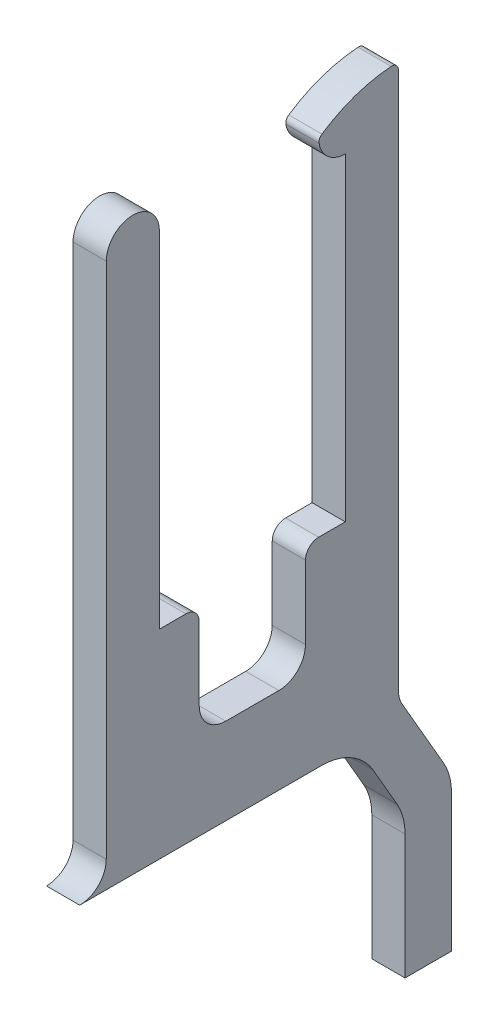
ISO-10303-21;
HEADER;
FILE_DESCRIPTION(('STEP AP214'),'2;1');
FILE_NAME('part.step','',(''),(''),'','','');
FILE_SCHEMA(('AUTOMOTIVE_DESIGN { 1 0 10303 214 1 1 1 1 }'));
ENDSEC;
DATA;
#1=APPLICATION_CONTEXT('core data for automotive mechanical design processes');
#2=APPLICATION_PROTOCOL_DEFINITION('international standard','automotive_design',2000,#1);
#3=PRODUCT_CONTEXT('',#1,'mechanical');
#4=PRODUCT('Part','Part','',(#3));
#5=PRODUCT_RELATED_PRODUCT_CATEGORY('part','',(#4));
#6=PRODUCT_DEFINITION_FORMATION('','',#4);
#7=PRODUCT_DEFINITION_CONTEXT('part definition',#1,'design');
#8=PRODUCT_DEFINITION('design','',#6,#7);
#9=PRODUCT_DEFINITION_SHAPE('','',#8);
#10=(LENGTH_UNIT() NAMED_UNIT(*) SI_UNIT(.MILLI.,.METRE.));
#11=(NAMED_UNIT(*) PLANE_ANGLE_UNIT() SI_UNIT($,.RADIAN.));
#12=(NAMED_UNIT(*) SI_UNIT($,.STERADIAN.) SOLID_ANGLE_UNIT());
#13=UNCERTAINTY_MEASURE_WITH_UNIT(LENGTH_MEASURE(1.E-05),#10,'distance_accuracy_value','');
#14=(GEOMETRIC_REPRESENTATION_CONTEXT(3) GLOBAL_UNCERTAINTY_ASSIGNED_CONTEXT((#13)) GLOBAL_UNIT_ASSIGNED_CONTEXT((#10,
#11,#12)) REPRESENTATION_CONTEXT('',''));
#15=CARTESIAN_POINT('',(0.,0.,0.));
#16=DIRECTION('',(0.,0.,1.));
#17=DIRECTION('',(1.,0.,0.));
#18=AXIS2_PLACEMENT_3D('',#15,#16,#17);
#19=CARTESIAN_POINT('',(-0.125,-1.3,-0.2));
#20=DIRECTION('',(-1.,0.,0.));
#21=DIRECTION('',(0.,-1.,0.));
#22=AXIS2_PLACEMENT_3D('',#19,#20,#21);
#23=PLANE('',#22);
#24=CARTESIAN_POINT('',(-0.125,1.95,-0.7));
#25=DIRECTION('',(1.,0.,0.));
#26=DIRECTION('',(0.,0.,-1.));
#27=AXIS2_PLACEMENT_3D('',#24,#25,#26);
#28=CIRCLE('',#27,0.200000000000005);
#29=CARTESIAN_POINT('',(-0.125,1.9170218477242,-0.502737632903597));
#30=VERTEX_POINT('',#29);
#31=CARTESIAN_POINT('',(-0.125,1.75,-0.7));
#32=VERTEX_POINT('',#31);
#33=EDGE_CURVE('E218',#30,#32,#28,.T.);
#34=ORIENTED_EDGE('',*,*,#33,.F.);
#35=CARTESIAN_POINT('',(-0.125,1.92526638579315,-0.552053224677697));
#36=DIRECTION('',(1.,0.,0.));
#37=DIRECTION('',(0.,0.,-1.));
#38=AXIS2_PLACEMENT_3D('',#35,#36,#37);
#39=CIRCLE('',#38,0.05);
#40=CARTESIAN_POINT('',(-0.125,1.96673103676035,-0.52411252461185));
#41=VERTEX_POINT('',#40);
#42=EDGE_CURVE('E342',#41,#30,#39,.T.);
#43=ORIENTED_EDGE('',*,*,#42,.F.);
#44=CARTESIAN_POINT('',(-0.125,1.075,-1.125));
#45=DIRECTION('',(1.,0.,0.));
#46=DIRECTION('',(0.,0.,-1.));
#47=AXIS2_PLACEMENT_3D('',#44,#45,#46);
#48=CIRCLE('',#47,1.07529065838034);
#49=CARTESIAN_POINT('',(-0.125,2.14740990194198,-1.04634250056864));
#50=VERTEX_POINT('',#49);
#51=EDGE_CURVE('E339',#50,#41,#48,.T.);
#52=ORIENTED_EDGE('',*,*,#51,.F.);
#53=CARTESIAN_POINT('',(-0.125,2.09754385439548,-1.05));
#54=DIRECTION('',(1.,0.,0.));
#55=DIRECTION('',(0.,0.,-1.));
#56=AXIS2_PLACEMENT_3D('',#53,#54,#55);
#57=CIRCLE('',#56,0.05);
#58=CARTESIAN_POINT('',(-0.125,2.09754385439548,-1.1));
#59=VERTEX_POINT('',#58);
#60=EDGE_CURVE('E206',#59,#50,#57,.T.);
#61=ORIENTED_EDGE('',*,*,#60,.F.);
#62=DIRECTION('',(0.,1.,0.));
#63=VECTOR('',#62,1.);
#64=CARTESIAN_POINT('',(-0.125,-2.15,-1.1));
#65=LINE('',#64,#63);
#66=CARTESIAN_POINT('',(-0.125,-1.95,-1.1));
#67=VERTEX_POINT('',#66);
#68=EDGE_CURVE('E201',#59,#67,#65,.F.);
#69=ORIENTED_EDGE('',*,*,#68,.T.);
#70=CARTESIAN_POINT('',(-0.125,-1.95,-1.3));
#71=DIRECTION('',(1.,0.,0.));
#72=DIRECTION('',(0.,0.,-1.));
#73=AXIS2_PLACEMENT_3D('',#70,#71,#72);
#74=CIRCLE('',#73,0.199999999999998);
#75=CARTESIAN_POINT('',(-0.125,-2.05,-1.12679491924311));
#76=VERTEX_POINT('',#75);
#77=EDGE_CURVE('E19',#67,#76,#74,.T.);
#78=ORIENTED_EDGE('',*,*,#77,.T.);
#79=DIRECTION('',(0.,0.866025403784439,0.5));
#80=VECTOR('',#79,1.);
#81=CARTESIAN_POINT('',(-0.125,-2.05,-1.12679491924311));
#82=LINE('',#81,#80);
#83=CARTESIAN_POINT('',(-0.125,-2.59198729810792,-1.43971143170307));
#84=VERTEX_POINT('',#83);
#85=EDGE_CURVE('E199',#84,#76,#82,.T.);
#86=ORIENTED_EDGE('',*,*,#85,.F.);
#87=CARTESIAN_POINT('',(-0.125,-2.81698729810792,-1.05000000000007));
#88=DIRECTION('',(1.,0.,0.));
#89=DIRECTION('',(0.,0.,-1.));
#90=AXIS2_PLACEMENT_3D('',#87,#88,#89);
#91=CIRCLE('',#90,0.45);
#92=CARTESIAN_POINT('',(-0.125,-2.81698729810792,-1.50000000000008));
#93=VERTEX_POINT('',#92);
#94=EDGE_CURVE('E363',#93,#84,#91,.T.);
#95=ORIENTED_EDGE('',*,*,#94,.F.);
#96=DIRECTION('',(0.,1.,0.));
#97=VECTOR('',#96,1.);
#98=CARTESIAN_POINT('',(-0.125,-3.85,-1.50000000000008));
#99=LINE('',#98,#97);
#100=CARTESIAN_POINT('',(-0.125,-3.85,-1.50000000000008));
#101=VERTEX_POINT('',#100);
#102=EDGE_CURVE('E280',#101,#93,#99,.T.);
#103=ORIENTED_EDGE('',*,*,#102,.F.);
#104=DIRECTION('',(0.,0.,-1.));
#105=VECTOR('',#104,1.);
#106=CARTESIAN_POINT('',(-0.125,-3.85,-1.15000000000007));
#107=LINE('',#106,#105);
#108=CARTESIAN_POINT('',(-0.125,-3.85,-1.15000000000008));
#109=VERTEX_POINT('',#108);
#110=EDGE_CURVE('E274',#109,#101,#107,.T.);
#111=ORIENTED_EDGE('',*,*,#110,.F.);
#112=DIRECTION('',(0.,-1.,0.));
#113=VECTOR('',#112,1.);
#114=CARTESIAN_POINT('',(-0.125,-2.79019237886481,-1.15000000000008));
#115=LINE('',#114,#113);
#116=CARTESIAN_POINT('',(-0.125,-2.91076951545881,-1.15000000000008));
#117=VERTEX_POINT('',#116);
#118=EDGE_CURVE('E267',#117,#109,#115,.T.);
#119=ORIENTED_EDGE('',*,*,#118,.F.);
#120=CARTESIAN_POINT('',(-0.125,-2.91076951545881,-0.700000000000075));
#121=DIRECTION('',(-1.,0.,0.));
#122=DIRECTION('',(0.,0.,1.));
#123=AXIS2_PLACEMENT_3D('',#120,#121,#122);
#124=CIRCLE('',#123,0.45);
#125=CARTESIAN_POINT('',(-0.125,-2.68576951545881,-1.08971143170307));
#126=VERTEX_POINT('',#125);
#127=EDGE_CURVE('E266',#117,#126,#124,.F.);
#128=ORIENTED_EDGE('',*,*,#127,.T.);
#129=DIRECTION('',(0.,-0.866025403784439,-0.5));
#130=VECTOR('',#129,1.);
#131=CARTESIAN_POINT('',(-0.125,-2.79019237886481,-1.15000000000008));
#132=LINE('',#131,#130);
#133=CARTESIAN_POINT('',(-0.125,-2.375,-0.910288568296999));
#134=VERTEX_POINT('',#133);
#135=EDGE_CURVE('E263',#134,#126,#132,.T.);
#136=ORIENTED_EDGE('',*,*,#135,.F.);
#137=CARTESIAN_POINT('',(-0.125,-2.6,-0.520577136594));
#138=DIRECTION('',(1.,0.,0.));
#139=DIRECTION('',(0.,0.,-1.));
#140=AXIS2_PLACEMENT_3D('',#137,#138,#139);
#141=CIRCLE('',#140,0.45);
#142=CARTESIAN_POINT('',(-0.125,-2.15,-0.520577136594));
#143=VERTEX_POINT('',#142);
#144=EDGE_CURVE('E358',#134,#143,#141,.T.);
#145=ORIENTED_EDGE('',*,*,#144,.T.);
#146=DIRECTION('',(0.,0.,1.));
#147=VECTOR('',#146,1.);
#148=CARTESIAN_POINT('',(-0.125,-2.15,1.1));
#149=LINE('',#148,#147);
#150=CARTESIAN_POINT('',(-0.125,-2.15,1.3));
#151=VERTEX_POINT('',#150);
#152=EDGE_CURVE('E259',#143,#151,#149,.T.);
#153=ORIENTED_EDGE('',*,*,#152,.T.);
#154=CARTESIAN_POINT('',(-0.125,-1.95,1.3));
#155=DIRECTION('',(1.,0.,0.));
#156=DIRECTION('',(0.,0.,-1.));
#157=AXIS2_PLACEMENT_3D('',#154,#155,#156);
#158=CIRCLE('',#157,0.199999999999998);
#159=CARTESIAN_POINT('',(-0.125,-1.95,1.1));
#160=VERTEX_POINT('',#159);
#161=EDGE_CURVE('E356',#151,#160,#158,.T.);
#162=ORIENTED_EDGE('',*,*,#161,.T.);
#163=DIRECTION('',(0.,1.,0.));
#164=VECTOR('',#163,1.);
#165=CARTESIAN_POINT('',(-0.125,2.15,1.1));
#166=LINE('',#165,#164);
#167=CARTESIAN_POINT('',(-0.125,1.95,1.1));
#168=VERTEX_POINT('',#167);
#169=EDGE_CURVE('E254',#160,#168,#166,.T.);
#170=ORIENTED_EDGE('',*,*,#169,.T.);
#171=CARTESIAN_POINT('',(-0.125,1.95,0.9));
#172=DIRECTION('',(1.,0.,0.));
#173=DIRECTION('',(0.,0.,-1.));
#174=AXIS2_PLACEMENT_3D('',#171,#172,#173);
#175=CIRCLE('',#174,0.2);
#176=CARTESIAN_POINT('',(-0.125,1.95,0.7));
#177=VERTEX_POINT('',#176);
#178=EDGE_CURVE('E257',#177,#168,#175,.T.);
#179=ORIENTED_EDGE('',*,*,#178,.F.);
#180=DIRECTION('',(0.,-1.,0.));
#181=VECTOR('',#180,1.);
#182=CARTESIAN_POINT('',(-0.125,2.15,0.7));
#183=LINE('',#182,#181);
#184=CARTESIAN_POINT('',(-0.125,-0.65,0.7));
#185=VERTEX_POINT('',#184);
#186=EDGE_CURVE('E248',#177,#185,#183,.T.);
#187=ORIENTED_EDGE('',*,*,#186,.T.);
#188=DIRECTION('',(0.,0.,-1.));
#189=VECTOR('',#188,1.);
#190=CARTESIAN_POINT('',(-0.125,-0.65,0.4));
#191=LINE('',#190,#189);
#192=CARTESIAN_POINT('',(-0.125,-0.65,0.5));
#193=VERTEX_POINT('',#192);
#194=EDGE_CURVE('E241',#185,#193,#191,.T.);
#195=ORIENTED_EDGE('',*,*,#194,.T.);
#196=CARTESIAN_POINT('',(-0.125,-0.75,0.5));
#197=DIRECTION('',(1.,0.,0.));
#198=DIRECTION('',(0.,0.,-1.));
#199=AXIS2_PLACEMENT_3D('',#196,#197,#198);
#200=CIRCLE('',#199,0.1);
#201=CARTESIAN_POINT('',(-0.125,-0.75,0.4));
#202=VERTEX_POINT('',#201);
#203=EDGE_CURVE('E244',#202,#193,#200,.T.);
#204=ORIENTED_EDGE('',*,*,#203,.F.);
#205=DIRECTION('',(0.,1.,0.));
#206=VECTOR('',#205,1.);
#207=CARTESIAN_POINT('',(-0.125,-1.3,0.4));
#208=LINE('',#207,#206);
#209=CARTESIAN_POINT('',(-0.125,-1.3,0.4));
#210=VERTEX_POINT('',#209);
#211=EDGE_CURVE('E237',#202,#210,#208,.F.);
#212=ORIENTED_EDGE('',*,*,#211,.T.);
#213=CARTESIAN_POINT('',(-0.125,-1.3,0.2));
#214=DIRECTION('',(1.,0.,0.));
#215=DIRECTION('',(0.,0.,-1.));
#216=AXIS2_PLACEMENT_3D('',#213,#214,#215);
#217=CIRCLE('',#216,0.2);
#218=CARTESIAN_POINT('',(-0.125,-1.5,0.2));
#219=VERTEX_POINT('',#218);
#220=EDGE_CURVE('E350',#210,#219,#217,.T.);
#221=ORIENTED_EDGE('',*,*,#220,.T.);
#222=DIRECTION('',(0.,0.,-1.));
#223=VECTOR('',#222,1.);
#224=CARTESIAN_POINT('',(-0.125,-1.5,0.2));
#225=LINE('',#224,#223);
#226=CARTESIAN_POINT('',(-0.125,-1.5,-0.2));
#227=VERTEX_POINT('',#226);
#228=EDGE_CURVE('E233',#219,#227,#225,.T.);
#229=ORIENTED_EDGE('',*,*,#228,.T.);
#230=CARTESIAN_POINT('',(-0.125,-1.3,-0.2));
#231=DIRECTION('',(1.,0.,0.));
#232=DIRECTION('',(0.,0.,-1.));
#233=AXIS2_PLACEMENT_3D('',#230,#231,#232);
#234=CIRCLE('',#233,0.2);
#235=CARTESIAN_POINT('',(-0.125,-1.3,-0.4));
#236=VERTEX_POINT('',#235);
#237=EDGE_CURVE('E348',#227,#236,#234,.T.);
#238=ORIENTED_EDGE('',*,*,#237,.T.);
#239=DIRECTION('',(0.,1.,0.));
#240=VECTOR('',#239,1.);
#241=CARTESIAN_POINT('',(-0.125,-1.3,-0.4));
#242=LINE('',#241,#240);
#243=CARTESIAN_POINT('',(-0.125,-0.75,-0.4));
#244=VERTEX_POINT('',#243);
#245=EDGE_CURVE('E228',#236,#244,#242,.T.);
#246=ORIENTED_EDGE('',*,*,#245,.T.);
#247=CARTESIAN_POINT('',(-0.125,-0.75,-0.5));
#248=DIRECTION('',(1.,0.,0.));
#249=DIRECTION('',(0.,0.,-1.));
#250=AXIS2_PLACEMENT_3D('',#247,#248,#249);
#251=CIRCLE('',#250,0.1);
#252=CARTESIAN_POINT('',(-0.125,-0.65,-0.5));
#253=VERTEX_POINT('',#252);
#254=EDGE_CURVE('E231',#253,#244,#251,.T.);
#255=ORIENTED_EDGE('',*,*,#254,.F.);
#256=DIRECTION('',(0.,0.,-1.));
#257=VECTOR('',#256,1.);
#258=CARTESIAN_POINT('',(-0.125,-0.65,-0.4));
#259=LINE('',#258,#257);
#260=CARTESIAN_POINT('',(-0.125,-0.65,-0.7));
#261=VERTEX_POINT('',#260);
#262=EDGE_CURVE('E222',#253,#261,#259,.T.);
#263=ORIENTED_EDGE('',*,*,#262,.T.);
#264=DIRECTION('',(0.,1.,0.));
#265=VECTOR('',#264,1.);
#266=CARTESIAN_POINT('',(-0.125,-0.65,-0.7));
#267=LINE('',#266,#265);
#268=EDGE_CURVE('E215',#261,#32,#267,.T.);
#269=ORIENTED_EDGE('',*,*,#268,.T.);
#270=EDGE_LOOP('',(#34,#43,#52,#61,#69,#78,#86,#95,#103,#111,#119,#128,#136,#145,#153,#162,#170,
#179,#187,#195,#204,#212,#221,#229,#238,#246,#255,#263,#269));
#271=FACE_BOUND('',#270,.T.);
#272=ADVANCED_FACE('F16',(#271),#23,.T.);
#273=CARTESIAN_POINT('',(0.125,-1.95,-1.3));
#274=DIRECTION('',(1.,0.,0.));
#275=DIRECTION('',(0.,0.,-1.));
#276=AXIS2_PLACEMENT_3D('',#273,#274,#275);
#277=CYLINDRICAL_SURFACE('',#276,0.199999999999998);
#278=DIRECTION('',(1.,0.,0.));
#279=VECTOR('',#278,1.);
#280=CARTESIAN_POINT('',(0.125,-1.95,-1.1));
#281=LINE('',#280,#279);
#282=CARTESIAN_POINT('',(0.125,-1.95,-1.1));
#283=VERTEX_POINT('',#282);
#284=EDGE_CURVE('E194',#67,#283,#281,.T.);
#285=ORIENTED_EDGE('',*,*,#284,.T.);
#286=CARTESIAN_POINT('',(0.125,-1.95,-1.3));
#287=DIRECTION('',(1.,0.,0.));
#288=DIRECTION('',(0.,0.,-1.));
#289=AXIS2_PLACEMENT_3D('',#286,#287,#288);
#290=CIRCLE('',#289,0.199999999999998);
#291=CARTESIAN_POINT('',(0.125,-2.05,-1.12679491924311));
#292=VERTEX_POINT('',#291);
#293=EDGE_CURVE('E207',#283,#292,#290,.T.);
#294=ORIENTED_EDGE('',*,*,#293,.T.);
#295=DIRECTION('',(1.,0.,0.));
#296=VECTOR('',#295,1.);
#297=CARTESIAN_POINT('',(0.125,-2.05,-1.12679491924311));
#298=LINE('',#297,#296);
#299=EDGE_CURVE('E195',#76,#292,#298,.T.);
#300=ORIENTED_EDGE('',*,*,#299,.F.);
#301=ORIENTED_EDGE('',*,*,#77,.F.);
#302=EDGE_LOOP('',(#285,#294,#300,#301));
#303=FACE_BOUND('',#302,.T.);
#304=ADVANCED_FACE('F192',(#303),#277,.F.);
#305=CARTESIAN_POINT('',(0.125,-2.05,-1.12679491924311));
#306=DIRECTION('',(0.,0.5,-0.866025403784439));
#307=DIRECTION('',(0.,0.866025403784439,0.5));
#308=AXIS2_PLACEMENT_3D('',#305,#306,#307);
#309=PLANE('',#308);
#310=ORIENTED_EDGE('',*,*,#85,.T.);
#311=ORIENTED_EDGE('',*,*,#299,.T.);
#312=DIRECTION('',(0.,-0.866025403784443,-0.499999999999993));
#313=VECTOR('',#312,1.);
#314=CARTESIAN_POINT('',(0.125,-2.05,-1.12679491924311));
#315=LINE('',#314,#313);
#316=CARTESIAN_POINT('',(0.125,-2.59198729810792,-1.43971143170307));
#317=VERTEX_POINT('',#316);
#318=EDGE_CURVE('E209',#292,#317,#315,.T.);
#319=ORIENTED_EDGE('',*,*,#318,.T.);
#320=DIRECTION('',(1.,0.,0.));
#321=VECTOR('',#320,1.);
#322=CARTESIAN_POINT('',(0.125,-2.59198729810792,-1.43971143170307));
#323=LINE('',#322,#321);
#324=EDGE_CURVE('E282',#84,#317,#323,.T.);
#325=ORIENTED_EDGE('',*,*,#324,.F.);
#326=EDGE_LOOP('',(#310,#311,#319,#325));
#327=FACE_BOUND('',#326,.T.);
#328=ADVANCED_FACE('F370',(#327),#309,.T.);
#329=CARTESIAN_POINT('',(0.125,-2.81698729810792,-1.05000000000007));
#330=DIRECTION('',(1.,0.,0.));
#331=DIRECTION('',(0.,0.,-1.));
#332=AXIS2_PLACEMENT_3D('',#329,#330,#331);
#333=CYLINDRICAL_SURFACE('',#332,0.45);
#334=ORIENTED_EDGE('',*,*,#94,.T.);
#335=ORIENTED_EDGE('',*,*,#324,.T.);
#336=CARTESIAN_POINT('',(0.125,-2.81698729810792,-1.05000000000007));
#337=DIRECTION('',(1.,0.,0.));
#338=DIRECTION('',(0.,0.,-1.));
#339=AXIS2_PLACEMENT_3D('',#336,#337,#338);
#340=CIRCLE('',#339,0.45);
#341=CARTESIAN_POINT('',(0.125,-2.81698729810792,-1.50000000000008));
#342=VERTEX_POINT('',#341);
#343=EDGE_CURVE('E333',#317,#342,#340,.F.);
#344=ORIENTED_EDGE('',*,*,#343,.T.);
#345=DIRECTION('',(1.,0.,0.));
#346=VECTOR('',#345,1.);
#347=CARTESIAN_POINT('',(0.125,-2.81698729810792,-1.50000000000008));
#348=LINE('',#347,#346);
#349=EDGE_CURVE('E277',#93,#342,#348,.T.);
#350=ORIENTED_EDGE('',*,*,#349,.F.);
#351=EDGE_LOOP('',(#334,#335,#344,#350));
#352=FACE_BOUND('',#351,.T.);
#353=ADVANCED_FACE('F442',(#352),#333,.T.);
#354=CARTESIAN_POINT('',(0.125,-3.85,-1.50000000000008));
#355=DIRECTION('',(0.,0.,-1.));
#356=DIRECTION('',(0.,1.,0.));
#357=AXIS2_PLACEMENT_3D('',#354,#355,#356);
#358=PLANE('',#357);
#359=DIRECTION('',(0.,-1.,0.));
#360=VECTOR('',#359,1.);
#361=CARTESIAN_POINT('',(0.125,-1.3,-1.50000000000008));
#362=LINE('',#361,#360);
#363=CARTESIAN_POINT('',(0.125,-3.85,-1.50000000000008));
#364=VERTEX_POINT('',#363);
#365=EDGE_CURVE('E335',#342,#364,#362,.T.);
#366=ORIENTED_EDGE('',*,*,#365,.T.);
#367=DIRECTION('',(1.,0.,0.));
#368=VECTOR('',#367,1.);
#369=CARTESIAN_POINT('',(0.125,-3.85,-1.50000000000008));
#370=LINE('',#369,#368);
#371=EDGE_CURVE('E271',#101,#364,#370,.T.);
#372=ORIENTED_EDGE('',*,*,#371,.F.);
#373=ORIENTED_EDGE('',*,*,#102,.T.);
#374=ORIENTED_EDGE('',*,*,#349,.T.);
#375=EDGE_LOOP('',(#366,#372,#373,#374));
#376=FACE_BOUND('',#375,.T.);
#377=ADVANCED_FACE('F437',(#376),#358,.T.);
#378=CARTESIAN_POINT('',(0.125,-3.85,-1.15000000000007));
#379=DIRECTION('',(0.,-1.,0.));
#380=DIRECTION('',(0.,0.,-1.));
#381=AXIS2_PLACEMENT_3D('',#378,#379,#380);
#382=PLANE('',#381);
#383=DIRECTION('',(0.,0.,1.));
#384=VECTOR('',#383,1.);
#385=CARTESIAN_POINT('',(0.125,-3.85,-0.2));
#386=LINE('',#385,#384);
#387=CARTESIAN_POINT('',(0.125,-3.85,-1.15000000000007));
#388=VERTEX_POINT('',#387);
#389=EDGE_CURVE('E426',#364,#388,#386,.T.);
#390=ORIENTED_EDGE('',*,*,#389,.T.);
#391=DIRECTION('',(1.,0.,0.));
#392=VECTOR('',#391,1.);
#393=CARTESIAN_POINT('',(0.125,-3.85,-1.15000000000008));
#394=LINE('',#393,#392);
#395=EDGE_CURVE('E270',#109,#388,#394,.T.);
#396=ORIENTED_EDGE('',*,*,#395,.F.);
#397=ORIENTED_EDGE('',*,*,#110,.T.);
#398=ORIENTED_EDGE('',*,*,#371,.T.);
#399=EDGE_LOOP('',(#390,#396,#397,#398));
#400=FACE_BOUND('',#399,.T.);
#401=ADVANCED_FACE('F450',(#400),#382,.T.);
#402=CARTESIAN_POINT('',(0.125,-2.79019237886481,-1.15000000000008));
#403=DIRECTION('',(0.,0.,1.));
#404=DIRECTION('',(0.,-1.,0.));
#405=AXIS2_PLACEMENT_3D('',#402,#403,#404);
#406=PLANE('',#405);
#407=ORIENTED_EDGE('',*,*,#118,.T.);
#408=ORIENTED_EDGE('',*,*,#395,.T.);
#409=DIRECTION('',(0.,-1.,0.));
#410=VECTOR('',#409,1.);
#411=CARTESIAN_POINT('',(0.125,-1.3,-1.15000000000007));
#412=LINE('',#411,#410);
#413=CARTESIAN_POINT('',(0.125,-2.91076951545881,-1.15000000000007));
#414=VERTEX_POINT('',#413);
#415=EDGE_CURVE('E332',#388,#414,#412,.F.);
#416=ORIENTED_EDGE('',*,*,#415,.T.);
#417=DIRECTION('',(-1.,0.,0.));
#418=VECTOR('',#417,1.);
#419=CARTESIAN_POINT('',(0.125,-2.91076951545881,-1.15000000000007));
#420=LINE('',#419,#418);
#421=EDGE_CURVE('E362',#414,#117,#420,.T.);
#422=ORIENTED_EDGE('',*,*,#421,.T.);
#423=EDGE_LOOP('',(#407,#408,#416,#422));
#424=FACE_BOUND('',#423,.T.);
#425=ADVANCED_FACE('F547',(#424),#406,.T.);
#426=CARTESIAN_POINT('',(0.125,-2.91076951545881,-0.700000000000075));
#427=DIRECTION('',(-1.,0.,0.));
#428=DIRECTION('',(0.,0.,1.));
#429=AXIS2_PLACEMENT_3D('',#426,#427,#428);
#430=CYLINDRICAL_SURFACE('',#429,0.45);
#431=DIRECTION('',(1.,0.,0.));
#432=VECTOR('',#431,1.);
#433=CARTESIAN_POINT('',(0.125,-2.68576951545881,-1.08971143170307));
#434=LINE('',#433,#432);
#435=CARTESIAN_POINT('',(0.125,-2.68576951545881,-1.08971143170307));
#436=VERTEX_POINT('',#435);
#437=EDGE_CURVE('E265',#126,#436,#434,.T.);
#438=ORIENTED_EDGE('',*,*,#437,.F.);
#439=ORIENTED_EDGE('',*,*,#127,.F.);
#440=ORIENTED_EDGE('',*,*,#421,.F.);
#441=CARTESIAN_POINT('',(0.125,-2.91076951545881,-0.700000000000075));
#442=DIRECTION('',(-1.,0.,0.));
#443=DIRECTION('',(0.,0.,1.));
#444=AXIS2_PLACEMENT_3D('',#441,#442,#443);
#445=CIRCLE('',#444,0.45);
#446=EDGE_CURVE('E329',#414,#436,#445,.F.);
#447=ORIENTED_EDGE('',*,*,#446,.T.);
#448=EDGE_LOOP('',(#438,#439,#440,#447));
#449=FACE_BOUND('',#448,.T.);
#450=ADVANCED_FACE('F543',(#449),#430,.F.);
#451=CARTESIAN_POINT('',(0.125,-2.79019237886481,-1.15000000000008));
#452=DIRECTION('',(0.,-0.5,0.866025403784439));
#453=DIRECTION('',(0.,-0.866025403784439,-0.5));
#454=AXIS2_PLACEMENT_3D('',#451,#452,#453);
#455=PLANE('',#454);
#456=ORIENTED_EDGE('',*,*,#135,.T.);
#457=ORIENTED_EDGE('',*,*,#437,.T.);
#458=DIRECTION('',(0.,0.866025403784439,0.499999999999999));
#459=VECTOR('',#458,1.);
#460=CARTESIAN_POINT('',(0.125,-2.68576951545881,-1.08971143170307));
#461=LINE('',#460,#459);
#462=CARTESIAN_POINT('',(0.125,-2.375,-0.910288568296997));
#463=VERTEX_POINT('',#462);
#464=EDGE_CURVE('E328',#436,#463,#461,.T.);
#465=ORIENTED_EDGE('',*,*,#464,.T.);
#466=DIRECTION('',(1.,0.,0.));
#467=VECTOR('',#466,1.);
#468=CARTESIAN_POINT('',(0.125,-2.375,-0.910288568296997));
#469=LINE('',#468,#467);
#470=EDGE_CURVE('E360',#463,#134,#469,.F.);
#471=ORIENTED_EDGE('',*,*,#470,.T.);
#472=EDGE_LOOP('',(#456,#457,#465,#471));
#473=FACE_BOUND('',#472,.T.);
#474=ADVANCED_FACE('F539',(#473),#455,.T.);
#475=CARTESIAN_POINT('',(0.125,-2.6,-0.520577136594));
#476=DIRECTION('',(1.,0.,0.));
#477=DIRECTION('',(0.,0.,-1.));
#478=AXIS2_PLACEMENT_3D('',#475,#476,#477);
#479=CYLINDRICAL_SURFACE('',#478,0.45);
#480=DIRECTION('',(1.,0.,0.));
#481=VECTOR('',#480,1.);
#482=CARTESIAN_POINT('',(0.125,-2.15,-0.520577136594));
#483=LINE('',#482,#481);
#484=CARTESIAN_POINT('',(0.125,-2.15,-0.520577136594));
#485=VERTEX_POINT('',#484);
#486=EDGE_CURVE('E262',#485,#143,#483,.F.);
#487=ORIENTED_EDGE('',*,*,#486,.T.);
#488=ORIENTED_EDGE('',*,*,#144,.F.);
#489=ORIENTED_EDGE('',*,*,#470,.F.);
#490=CARTESIAN_POINT('',(0.125,-2.6,-0.520577136594));
#491=DIRECTION('',(1.,0.,0.));
#492=DIRECTION('',(0.,0.,-1.));
#493=AXIS2_PLACEMENT_3D('',#490,#491,#492);
#494=CIRCLE('',#493,0.45);
#495=EDGE_CURVE('E325',#463,#485,#494,.T.);
#496=ORIENTED_EDGE('',*,*,#495,.T.);
#497=EDGE_LOOP('',(#487,#488,#489,#496));
#498=FACE_BOUND('',#497,.T.);
#499=ADVANCED_FACE('F535',(#498),#479,.F.);
#500=CARTESIAN_POINT('',(0.125,-2.15,1.1));
#501=DIRECTION('',(0.,1.,0.));
#502=DIRECTION('',(0.,0.,1.));
#503=AXIS2_PLACEMENT_3D('',#500,#501,#502);
#504=PLANE('',#503);
#505=ORIENTED_EDGE('',*,*,#486,.F.);
#506=DIRECTION('',(0.,0.,1.));
#507=VECTOR('',#506,1.);
#508=CARTESIAN_POINT('',(0.125,-2.15,-0.2));
#509=LINE('',#508,#507);
#510=CARTESIAN_POINT('',(0.125,-2.15,1.3));
#511=VERTEX_POINT('',#510);
#512=EDGE_CURVE('E324',#485,#511,#509,.T.);
#513=ORIENTED_EDGE('',*,*,#512,.T.);
#514=DIRECTION('',(1.,0.,0.));
#515=VECTOR('',#514,1.);
#516=CARTESIAN_POINT('',(0.125,-2.15,1.3));
#517=LINE('',#516,#515);
#518=EDGE_CURVE('E261',#511,#151,#517,.F.);
#519=ORIENTED_EDGE('',*,*,#518,.T.);
#520=ORIENTED_EDGE('',*,*,#152,.F.);
#521=EDGE_LOOP('',(#505,#513,#519,#520));
#522=FACE_BOUND('',#521,.T.);
#523=ADVANCED_FACE('F531',(#522),#504,.F.);
#524=CARTESIAN_POINT('',(0.125,-1.95,1.3));
#525=DIRECTION('',(1.,0.,0.));
#526=DIRECTION('',(0.,0.,-1.));
#527=AXIS2_PLACEMENT_3D('',#524,#525,#526);
#528=CYLINDRICAL_SURFACE('',#527,0.199999999999998);
#529=ORIENTED_EDGE('',*,*,#518,.F.);
#530=CARTESIAN_POINT('',(0.125,-1.95,1.3));
#531=DIRECTION('',(1.,0.,0.));
#532=DIRECTION('',(0.,0.,-1.));
#533=AXIS2_PLACEMENT_3D('',#530,#531,#532);
#534=CIRCLE('',#533,0.199999999999998);
#535=CARTESIAN_POINT('',(0.125,-1.95,1.1));
#536=VERTEX_POINT('',#535);
#537=EDGE_CURVE('E321',#511,#536,#534,.T.);
#538=ORIENTED_EDGE('',*,*,#537,.T.);
#539=DIRECTION('',(-1.,0.,0.));
#540=VECTOR('',#539,1.);
#541=CARTESIAN_POINT('',(0.125,-1.95,1.1));
#542=LINE('',#541,#540);
#543=EDGE_CURVE('E258',#536,#160,#542,.T.);
#544=ORIENTED_EDGE('',*,*,#543,.T.);
#545=ORIENTED_EDGE('',*,*,#161,.F.);
#546=EDGE_LOOP('',(#529,#538,#544,#545));
#547=FACE_BOUND('',#546,.T.);
#548=ADVANCED_FACE('F527',(#547),#528,.F.);
#549=CARTESIAN_POINT('',(0.125,2.15,1.1));
#550=DIRECTION('',(0.,0.,-1.));
#551=DIRECTION('',(-1.,0.,0.));
#552=AXIS2_PLACEMENT_3D('',#549,#550,#551);
#553=PLANE('',#552);
#554=DIRECTION('',(1.,0.,0.));
#555=VECTOR('',#554,1.);
#556=CARTESIAN_POINT('',(0.125,1.95,1.1));
#557=LINE('',#556,#555);
#558=CARTESIAN_POINT('',(0.125,1.95,1.1));
#559=VERTEX_POINT('',#558);
#560=EDGE_CURVE('E355',#168,#559,#557,.T.);
#561=ORIENTED_EDGE('',*,*,#560,.F.);
#562=ORIENTED_EDGE('',*,*,#169,.F.);
#563=ORIENTED_EDGE('',*,*,#543,.F.);
#564=DIRECTION('',(0.,-1.,0.));
#565=VECTOR('',#564,1.);
#566=CARTESIAN_POINT('',(0.125,-1.3,1.1));
#567=LINE('',#566,#565);
#568=EDGE_CURVE('E320',#536,#559,#567,.F.);
#569=ORIENTED_EDGE('',*,*,#568,.T.);
#570=EDGE_LOOP('',(#561,#562,#563,#569));
#571=FACE_BOUND('',#570,.T.);
#572=ADVANCED_FACE('F523',(#571),#553,.F.);
#573=CARTESIAN_POINT('',(0.125,1.95,0.9));
#574=DIRECTION('',(1.,0.,0.));
#575=DIRECTION('',(0.,0.,-1.));
#576=AXIS2_PLACEMENT_3D('',#573,#574,#575);
#577=CYLINDRICAL_SURFACE('',#576,0.2);
#578=ORIENTED_EDGE('',*,*,#178,.T.);
#579=ORIENTED_EDGE('',*,*,#560,.T.);
#580=CARTESIAN_POINT('',(0.125,1.95,0.9));
#581=DIRECTION('',(1.,0.,0.));
#582=DIRECTION('',(0.,0.,-1.));
#583=AXIS2_PLACEMENT_3D('',#580,#581,#582);
#584=CIRCLE('',#583,0.2);
#585=CARTESIAN_POINT('',(0.125,1.95,0.7));
#586=VERTEX_POINT('',#585);
#587=EDGE_CURVE('E316',#559,#586,#584,.F.);
#588=ORIENTED_EDGE('',*,*,#587,.T.);
#589=DIRECTION('',(1.,0.,0.));
#590=VECTOR('',#589,1.);
#591=CARTESIAN_POINT('',(0.125,1.95,0.7));
#592=LINE('',#591,#590);
#593=EDGE_CURVE('E251',#586,#177,#592,.F.);
#594=ORIENTED_EDGE('',*,*,#593,.T.);
#595=EDGE_LOOP('',(#578,#579,#588,#594));
#596=FACE_BOUND('',#595,.T.);
#597=ADVANCED_FACE('F519',(#596),#577,.T.);
#598=CARTESIAN_POINT('',(0.125,2.15,0.7));
#599=DIRECTION('',(0.,0.,1.));
#600=DIRECTION('',(0.,-1.,0.));
#601=AXIS2_PLACEMENT_3D('',#598,#599,#600);
#602=PLANE('',#601);
#603=ORIENTED_EDGE('',*,*,#593,.F.);
#604=DIRECTION('',(0.,-1.,0.));
#605=VECTOR('',#604,1.);
#606=CARTESIAN_POINT('',(0.125,-1.3,0.7));
#607=LINE('',#606,#605);
#608=CARTESIAN_POINT('',(0.125,-0.65,0.7));
#609=VERTEX_POINT('',#608);
#610=EDGE_CURVE('E319',#586,#609,#607,.T.);
#611=ORIENTED_EDGE('',*,*,#610,.T.);
#612=DIRECTION('',(1.,0.,0.));
#613=VECTOR('',#612,1.);
#614=CARTESIAN_POINT('',(0.125,-0.65,0.7));
#615=LINE('',#614,#613);
#616=EDGE_CURVE('E245',#609,#185,#615,.F.);
#617=ORIENTED_EDGE('',*,*,#616,.T.);
#618=ORIENTED_EDGE('',*,*,#186,.F.);
#619=EDGE_LOOP('',(#603,#611,#617,#618));
#620=FACE_BOUND('',#619,.T.);
#621=ADVANCED_FACE('F515',(#620),#602,.F.);
#622=CARTESIAN_POINT('',(0.125,-0.65,0.4));
#623=DIRECTION('',(0.,-1.,0.));
#624=DIRECTION('',(0.,0.,-1.));
#625=AXIS2_PLACEMENT_3D('',#622,#623,#624);
#626=PLANE('',#625);
#627=DIRECTION('',(1.,0.,0.));
#628=VECTOR('',#627,1.);
#629=CARTESIAN_POINT('',(0.125,-0.65,0.5));
#630=LINE('',#629,#628);
#631=CARTESIAN_POINT('',(0.125,-0.65,0.5));
#632=VERTEX_POINT('',#631);
#633=EDGE_CURVE('E353',#193,#632,#630,.T.);
#634=ORIENTED_EDGE('',*,*,#633,.F.);
#635=ORIENTED_EDGE('',*,*,#194,.F.);
#636=ORIENTED_EDGE('',*,*,#616,.F.);
#637=DIRECTION('',(0.,0.,1.));
#638=VECTOR('',#637,1.);
#639=CARTESIAN_POINT('',(0.125,-0.65,-0.2));
#640=LINE('',#639,#638);
#641=EDGE_CURVE('E315',#609,#632,#640,.F.);
#642=ORIENTED_EDGE('',*,*,#641,.T.);
#643=EDGE_LOOP('',(#634,#635,#636,#642));
#644=FACE_BOUND('',#643,.T.);
#645=ADVANCED_FACE('F511',(#644),#626,.F.);
#646=CARTESIAN_POINT('',(0.125,-0.75,0.5));
#647=DIRECTION('',(1.,0.,0.));
#648=DIRECTION('',(0.,0.,-1.));
#649=AXIS2_PLACEMENT_3D('',#646,#647,#648);
#650=CYLINDRICAL_SURFACE('',#649,0.1);
#651=ORIENTED_EDGE('',*,*,#203,.T.);
#652=ORIENTED_EDGE('',*,*,#633,.T.);
#653=CARTESIAN_POINT('',(0.125,-0.75,0.5));
#654=DIRECTION('',(1.,0.,0.));
#655=DIRECTION('',(0.,0.,-1.));
#656=AXIS2_PLACEMENT_3D('',#653,#654,#655);
#657=CIRCLE('',#656,0.1);
#658=CARTESIAN_POINT('',(0.125,-0.75,0.4));
#659=VERTEX_POINT('',#658);
#660=EDGE_CURVE('E312',#632,#659,#657,.F.);
#661=ORIENTED_EDGE('',*,*,#660,.T.);
#662=DIRECTION('',(1.,0.,0.));
#663=VECTOR('',#662,1.);
#664=CARTESIAN_POINT('',(0.125,-0.75,0.4));
#665=LINE('',#664,#663);
#666=EDGE_CURVE('E240',#659,#202,#665,.F.);
#667=ORIENTED_EDGE('',*,*,#666,.T.);
#668=EDGE_LOOP('',(#651,#652,#661,#667));
#669=FACE_BOUND('',#668,.T.);
#670=ADVANCED_FACE('F507',(#669),#650,.T.);
#671=CARTESIAN_POINT('',(0.125,-1.3,0.4));
#672=DIRECTION('',(0.,0.,1.));
#673=DIRECTION('',(1.,0.,0.));
#674=AXIS2_PLACEMENT_3D('',#671,#672,#673);
#675=PLANE('',#674);
#676=ORIENTED_EDGE('',*,*,#666,.F.);
#677=DIRECTION('',(0.,-1.,0.));
#678=VECTOR('',#677,1.);
#679=CARTESIAN_POINT('',(0.125,-1.3,0.4));
#680=LINE('',#679,#678);
#681=CARTESIAN_POINT('',(0.125,-1.3,0.4));
#682=VERTEX_POINT('',#681);
#683=EDGE_CURVE('E311',#659,#682,#680,.T.);
#684=ORIENTED_EDGE('',*,*,#683,.T.);
#685=DIRECTION('',(1.,0.,0.));
#686=VECTOR('',#685,1.);
#687=CARTESIAN_POINT('',(0.125,-1.3,0.4));
#688=LINE('',#687,#686);
#689=EDGE_CURVE('E239',#682,#210,#688,.F.);
#690=ORIENTED_EDGE('',*,*,#689,.T.);
#691=ORIENTED_EDGE('',*,*,#211,.F.);
#692=EDGE_LOOP('',(#676,#684,#690,#691));
#693=FACE_BOUND('',#692,.T.);
#694=ADVANCED_FACE('F503',(#693),#675,.F.);
#695=CARTESIAN_POINT('',(0.125,-1.3,0.2));
#696=DIRECTION('',(1.,0.,0.));
#697=DIRECTION('',(0.,0.,-1.));
#698=AXIS2_PLACEMENT_3D('',#695,#696,#697);
#699=CYLINDRICAL_SURFACE('',#698,0.2);
#700=ORIENTED_EDGE('',*,*,#689,.F.);
#701=CARTESIAN_POINT('',(0.125,-1.3,0.2));
#702=DIRECTION('',(1.,0.,0.));
#703=DIRECTION('',(0.,0.,-1.));
#704=AXIS2_PLACEMENT_3D('',#701,#702,#703);
#705=CIRCLE('',#704,0.2);
#706=CARTESIAN_POINT('',(0.125,-1.5,0.2));
#707=VERTEX_POINT('',#706);
#708=EDGE_CURVE('E308',#682,#707,#705,.T.);
#709=ORIENTED_EDGE('',*,*,#708,.T.);
#710=DIRECTION('',(1.,0.,0.));
#711=VECTOR('',#710,1.);
#712=CARTESIAN_POINT('',(0.125,-1.5,0.2));
#713=LINE('',#712,#711);
#714=EDGE_CURVE('E236',#707,#219,#713,.F.);
#715=ORIENTED_EDGE('',*,*,#714,.T.);
#716=ORIENTED_EDGE('',*,*,#220,.F.);
#717=EDGE_LOOP('',(#700,#709,#715,#716));
#718=FACE_BOUND('',#717,.T.);
#719=ADVANCED_FACE('F499',(#718),#699,.F.);
#720=CARTESIAN_POINT('',(0.125,-1.5,0.2));
#721=DIRECTION('',(0.,-1.,0.));
#722=DIRECTION('',(0.,0.,-1.));
#723=AXIS2_PLACEMENT_3D('',#720,#721,#722);
#724=PLANE('',#723);
#725=ORIENTED_EDGE('',*,*,#714,.F.);
#726=DIRECTION('',(0.,0.,1.));
#727=VECTOR('',#726,1.);
#728=CARTESIAN_POINT('',(0.125,-1.5,-0.2));
#729=LINE('',#728,#727);
#730=CARTESIAN_POINT('',(0.125,-1.5,-0.2));
#731=VERTEX_POINT('',#730);
#732=EDGE_CURVE('E307',#707,#731,#729,.F.);
#733=ORIENTED_EDGE('',*,*,#732,.T.);
#734=DIRECTION('',(1.,0.,0.));
#735=VECTOR('',#734,1.);
#736=CARTESIAN_POINT('',(0.125,-1.5,-0.2));
#737=LINE('',#736,#735);
#738=EDGE_CURVE('E235',#731,#227,#737,.F.);
#739=ORIENTED_EDGE('',*,*,#738,.T.);
#740=ORIENTED_EDGE('',*,*,#228,.F.);
#741=EDGE_LOOP('',(#725,#733,#739,#740));
#742=FACE_BOUND('',#741,.T.);
#743=ADVANCED_FACE('F495',(#742),#724,.F.);
#744=CARTESIAN_POINT('',(0.125,-1.3,-0.2));
#745=DIRECTION('',(1.,0.,0.));
#746=DIRECTION('',(0.,0.,-1.));
#747=AXIS2_PLACEMENT_3D('',#744,#745,#746);
#748=CYLINDRICAL_SURFACE('',#747,0.2);
#749=ORIENTED_EDGE('',*,*,#738,.F.);
#750=CARTESIAN_POINT('',(0.125,-1.3,-0.2));
#751=DIRECTION('',(1.,0.,0.));
#752=DIRECTION('',(0.,0.,-1.));
#753=AXIS2_PLACEMENT_3D('',#750,#751,#752);
#754=CIRCLE('',#753,0.2);
#755=CARTESIAN_POINT('',(0.125,-1.3,-0.4));
#756=VERTEX_POINT('',#755);
#757=EDGE_CURVE('E304',#731,#756,#754,.T.);
#758=ORIENTED_EDGE('',*,*,#757,.T.);
#759=DIRECTION('',(-1.,0.,0.));
#760=VECTOR('',#759,1.);
#761=CARTESIAN_POINT('',(0.125,-1.3,-0.4));
#762=LINE('',#761,#760);
#763=EDGE_CURVE('E232',#756,#236,#762,.T.);
#764=ORIENTED_EDGE('',*,*,#763,.T.);
#765=ORIENTED_EDGE('',*,*,#237,.F.);
#766=EDGE_LOOP('',(#749,#758,#764,#765));
#767=FACE_BOUND('',#766,.T.);
#768=ADVANCED_FACE('F491',(#767),#748,.F.);
#769=CARTESIAN_POINT('',(0.125,-1.3,-0.4));
#770=DIRECTION('',(0.,0.,-1.));
#771=DIRECTION('',(-1.,0.,0.));
#772=AXIS2_PLACEMENT_3D('',#769,#770,#771);
#773=PLANE('',#772);
#774=DIRECTION('',(1.,0.,0.));
#775=VECTOR('',#774,1.);
#776=CARTESIAN_POINT('',(0.125,-0.75,-0.4));
#777=LINE('',#776,#775);
#778=CARTESIAN_POINT('',(0.125,-0.75,-0.4));
#779=VERTEX_POINT('',#778);
#780=EDGE_CURVE('E347',#244,#779,#777,.T.);
#781=ORIENTED_EDGE('',*,*,#780,.F.);
#782=ORIENTED_EDGE('',*,*,#245,.F.);
#783=ORIENTED_EDGE('',*,*,#763,.F.);
#784=DIRECTION('',(0.,-1.,0.));
#785=VECTOR('',#784,1.);
#786=CARTESIAN_POINT('',(0.125,-1.3,-0.4));
#787=LINE('',#786,#785);
#788=EDGE_CURVE('E303',#756,#779,#787,.F.);
#789=ORIENTED_EDGE('',*,*,#788,.T.);
#790=EDGE_LOOP('',(#781,#782,#783,#789));
#791=FACE_BOUND('',#790,.T.);
#792=ADVANCED_FACE('F487',(#791),#773,.F.);
#793=CARTESIAN_POINT('',(0.125,-0.75,-0.5));
#794=DIRECTION('',(1.,0.,0.));
#795=DIRECTION('',(0.,0.,-1.));
#796=AXIS2_PLACEMENT_3D('',#793,#794,#795);
#797=CYLINDRICAL_SURFACE('',#796,0.1);
#798=ORIENTED_EDGE('',*,*,#254,.T.);
#799=ORIENTED_EDGE('',*,*,#780,.T.);
#800=CARTESIAN_POINT('',(0.125,-0.75,-0.5));
#801=DIRECTION('',(1.,0.,0.));
#802=DIRECTION('',(0.,0.,-1.));
#803=AXIS2_PLACEMENT_3D('',#800,#801,#802);
#804=CIRCLE('',#803,0.1);
#805=CARTESIAN_POINT('',(0.125,-0.65,-0.5));
#806=VERTEX_POINT('',#805);
#807=EDGE_CURVE('E299',#779,#806,#804,.F.);
#808=ORIENTED_EDGE('',*,*,#807,.T.);
#809=DIRECTION('',(1.,0.,0.));
#810=VECTOR('',#809,1.);
#811=CARTESIAN_POINT('',(0.125,-0.65,-0.5));
#812=LINE('',#811,#810);
#813=EDGE_CURVE('E225',#806,#253,#812,.F.);
#814=ORIENTED_EDGE('',*,*,#813,.T.);
#815=EDGE_LOOP('',(#798,#799,#808,#814));
#816=FACE_BOUND('',#815,.T.);
#817=ADVANCED_FACE('F483',(#816),#797,.T.);
#818=CARTESIAN_POINT('',(0.125,-0.65,-0.4));
#819=DIRECTION('',(0.,-1.,0.));
#820=DIRECTION('',(0.,0.,-1.));
#821=AXIS2_PLACEMENT_3D('',#818,#819,#820);
#822=PLANE('',#821);
#823=ORIENTED_EDGE('',*,*,#813,.F.);
#824=DIRECTION('',(0.,0.,1.));
#825=VECTOR('',#824,1.);
#826=CARTESIAN_POINT('',(0.125,-0.65,-0.2));
#827=LINE('',#826,#825);
#828=CARTESIAN_POINT('',(0.125,-0.65,-0.7));
#829=VERTEX_POINT('',#828);
#830=EDGE_CURVE('E302',#806,#829,#827,.F.);
#831=ORIENTED_EDGE('',*,*,#830,.T.);
#832=DIRECTION('',(-1.,0.,0.));
#833=VECTOR('',#832,1.);
#834=CARTESIAN_POINT('',(0.125,-0.65,-0.7));
#835=LINE('',#834,#833);
#836=EDGE_CURVE('E219',#829,#261,#835,.T.);
#837=ORIENTED_EDGE('',*,*,#836,.T.);
#838=ORIENTED_EDGE('',*,*,#262,.F.);
#839=EDGE_LOOP('',(#823,#831,#837,#838));
#840=FACE_BOUND('',#839,.T.);
#841=ADVANCED_FACE('F479',(#840),#822,.F.);
#842=CARTESIAN_POINT('',(0.125,-0.65,-0.7));
#843=DIRECTION('',(0.,0.,-1.));
#844=DIRECTION('',(-1.,0.,0.));
#845=AXIS2_PLACEMENT_3D('',#842,#843,#844);
#846=PLANE('',#845);
#847=ORIENTED_EDGE('',*,*,#268,.F.);
#848=ORIENTED_EDGE('',*,*,#836,.F.);
#849=DIRECTION('',(0.,-1.,0.));
#850=VECTOR('',#849,1.);
#851=CARTESIAN_POINT('',(0.125,-1.3,-0.7));
#852=LINE('',#851,#850);
#853=CARTESIAN_POINT('',(0.125,1.74999999999999,-0.7));
#854=VERTEX_POINT('',#853);
#855=EDGE_CURVE('E298',#829,#854,#852,.F.);
#856=ORIENTED_EDGE('',*,*,#855,.T.);
#857=DIRECTION('',(1.,0.,0.));
#858=VECTOR('',#857,1.);
#859=CARTESIAN_POINT('',(0.125,1.74999999999999,-0.7));
#860=LINE('',#859,#858);
#861=EDGE_CURVE('E344',#32,#854,#860,.T.);
#862=ORIENTED_EDGE('',*,*,#861,.F.);
#863=EDGE_LOOP('',(#847,#848,#856,#862));
#864=FACE_BOUND('',#863,.T.);
#865=ADVANCED_FACE('F475',(#864),#846,.F.);
#866=CARTESIAN_POINT('',(0.125,1.95,-0.7));
#867=DIRECTION('',(1.,0.,0.));
#868=DIRECTION('',(0.,0.,-1.));
#869=AXIS2_PLACEMENT_3D('',#866,#867,#868);
#870=CYLINDRICAL_SURFACE('',#869,0.200000000000005);
#871=ORIENTED_EDGE('',*,*,#33,.T.);
#872=ORIENTED_EDGE('',*,*,#861,.T.);
#873=CARTESIAN_POINT('',(0.125,1.95,-0.7));
#874=DIRECTION('',(1.,0.,0.));
#875=DIRECTION('',(0.,0.,-1.));
#876=AXIS2_PLACEMENT_3D('',#873,#874,#875);
#877=CIRCLE('',#876,0.200000000000005);
#878=CARTESIAN_POINT('',(0.125,1.9170218477242,-0.502737632903597));
#879=VERTEX_POINT('',#878);
#880=EDGE_CURVE('E295',#854,#879,#877,.F.);
#881=ORIENTED_EDGE('',*,*,#880,.T.);
#882=DIRECTION('',(1.,0.,0.));
#883=VECTOR('',#882,1.);
#884=CARTESIAN_POINT('',(0.125,1.9170218477242,-0.502737632903598));
#885=LINE('',#884,#883);
#886=EDGE_CURVE('E341',#30,#879,#885,.T.);
#887=ORIENTED_EDGE('',*,*,#886,.F.);
#888=EDGE_LOOP('',(#871,#872,#881,#887));
#889=FACE_BOUND('',#888,.T.);
#890=ADVANCED_FACE('F471',(#889),#870,.T.);
#891=CARTESIAN_POINT('',(0.125,1.92526638579315,-0.552053224677697));
#892=DIRECTION('',(1.,0.,0.));
#893=DIRECTION('',(0.,0.,-1.));
#894=AXIS2_PLACEMENT_3D('',#891,#892,#893);
#895=CYLINDRICAL_SURFACE('',#894,0.05);
#896=ORIENTED_EDGE('',*,*,#42,.T.);
#897=ORIENTED_EDGE('',*,*,#886,.T.);
#898=CARTESIAN_POINT('',(0.125,1.92526638579315,-0.552053224677697));
#899=DIRECTION('',(1.,0.,0.));
#900=DIRECTION('',(0.,0.,-1.));
#901=AXIS2_PLACEMENT_3D('',#898,#899,#900);
#902=CIRCLE('',#901,0.05);
#903=CARTESIAN_POINT('',(0.125,1.96673103676035,-0.52411252461185));
#904=VERTEX_POINT('',#903);
#905=EDGE_CURVE('E292',#879,#904,#902,.F.);
#906=ORIENTED_EDGE('',*,*,#905,.T.);
#907=DIRECTION('',(1.,0.,0.));
#908=VECTOR('',#907,1.);
#909=CARTESIAN_POINT('',(0.125,1.96673103676035,-0.524112524611851));
#910=LINE('',#909,#908);
#911=EDGE_CURVE('E338',#41,#904,#910,.T.);
#912=ORIENTED_EDGE('',*,*,#911,.F.);
#913=EDGE_LOOP('',(#896,#897,#906,#912));
#914=FACE_BOUND('',#913,.T.);
#915=ADVANCED_FACE('F467',(#914),#895,.T.);
#916=CARTESIAN_POINT('',(0.125,1.075,-1.125));
#917=DIRECTION('',(1.,0.,0.));
#918=DIRECTION('',(0.,0.,-1.));
#919=AXIS2_PLACEMENT_3D('',#916,#917,#918);
#920=CYLINDRICAL_SURFACE('',#919,1.07529065838034);
#921=ORIENTED_EDGE('',*,*,#51,.T.);
#922=ORIENTED_EDGE('',*,*,#911,.T.);
#923=CARTESIAN_POINT('',(0.125,1.075,-1.125));
#924=DIRECTION('',(1.,0.,0.));
#925=DIRECTION('',(0.,0.,-1.));
#926=AXIS2_PLACEMENT_3D('',#923,#924,#925);
#927=CIRCLE('',#926,1.07529065838034);
#928=CARTESIAN_POINT('',(0.125,2.14740990194198,-1.04634250056864));
#929=VERTEX_POINT('',#928);
#930=EDGE_CURVE('E289',#904,#929,#927,.F.);
#931=ORIENTED_EDGE('',*,*,#930,.T.);
#932=DIRECTION('',(1.,0.,0.));
#933=VECTOR('',#932,1.);
#934=CARTESIAN_POINT('',(0.125,2.14740990194198,-1.04634250056864));
#935=LINE('',#934,#933);
#936=EDGE_CURVE('E202',#50,#929,#935,.T.);
#937=ORIENTED_EDGE('',*,*,#936,.F.);
#938=EDGE_LOOP('',(#921,#922,#931,#937));
#939=FACE_BOUND('',#938,.T.);
#940=ADVANCED_FACE('F463',(#939),#920,.T.);
#941=CARTESIAN_POINT('',(0.125,2.09754385439548,-1.05));
#942=DIRECTION('',(1.,0.,0.));
#943=DIRECTION('',(0.,0.,-1.));
#944=AXIS2_PLACEMENT_3D('',#941,#942,#943);
#945=CYLINDRICAL_SURFACE('',#944,0.05);
#946=ORIENTED_EDGE('',*,*,#60,.T.);
#947=ORIENTED_EDGE('',*,*,#936,.T.);
#948=CARTESIAN_POINT('',(0.125,2.09754385439548,-1.05));
#949=DIRECTION('',(1.,0.,0.));
#950=DIRECTION('',(0.,0.,-1.));
#951=AXIS2_PLACEMENT_3D('',#948,#949,#950);
#952=CIRCLE('',#951,0.05);
#953=CARTESIAN_POINT('',(0.125,2.09754385439548,-1.1));
#954=VERTEX_POINT('',#953);
#955=EDGE_CURVE('E25',#929,#954,#952,.F.);
#956=ORIENTED_EDGE('',*,*,#955,.T.);
#957=DIRECTION('',(1.,0.,0.));
#958=VECTOR('',#957,1.);
#959=CARTESIAN_POINT('',(0.125,2.09754385439548,-1.1));
#960=LINE('',#959,#958);
#961=EDGE_CURVE('E33',#954,#59,#960,.F.);
#962=ORIENTED_EDGE('',*,*,#961,.T.);
#963=EDGE_LOOP('',(#946,#947,#956,#962));
#964=FACE_BOUND('',#963,.T.);
#965=ADVANCED_FACE('F458',(#964),#945,.T.);
#966=CARTESIAN_POINT('',(0.125,-2.15,-1.1));
#967=DIRECTION('',(0.,0.,1.));
#968=DIRECTION('',(1.,0.,0.));
#969=AXIS2_PLACEMENT_3D('',#966,#967,#968);
#970=PLANE('',#969);
#971=ORIENTED_EDGE('',*,*,#961,.F.);
#972=DIRECTION('',(0.,-1.,0.));
#973=VECTOR('',#972,1.);
#974=CARTESIAN_POINT('',(0.125,-1.3,-1.1));
#975=LINE('',#974,#973);
#976=EDGE_CURVE('E11',#954,#283,#975,.T.);
#977=ORIENTED_EDGE('',*,*,#976,.T.);
#978=ORIENTED_EDGE('',*,*,#284,.F.);
#979=ORIENTED_EDGE('',*,*,#68,.F.);
#980=EDGE_LOOP('',(#971,#977,#978,#979));
#981=FACE_BOUND('',#980,.T.);
#982=ADVANCED_FACE('F200',(#981),#970,.F.);
#983=CARTESIAN_POINT('',(0.125,-1.3,-0.2));
#984=DIRECTION('',(-1.,0.,0.));
#985=DIRECTION('',(0.,-1.,0.));
#986=AXIS2_PLACEMENT_3D('',#983,#984,#985);
#987=PLANE('',#986);
#988=ORIENTED_EDGE('',*,*,#955,.F.);
#989=ORIENTED_EDGE('',*,*,#930,.F.);
#990=ORIENTED_EDGE('',*,*,#905,.F.);
#991=ORIENTED_EDGE('',*,*,#880,.F.);
#992=ORIENTED_EDGE('',*,*,#855,.F.);
#993=ORIENTED_EDGE('',*,*,#830,.F.);
#994=ORIENTED_EDGE('',*,*,#807,.F.);
#995=ORIENTED_EDGE('',*,*,#788,.F.);
#996=ORIENTED_EDGE('',*,*,#757,.F.);
#997=ORIENTED_EDGE('',*,*,#732,.F.);
#998=ORIENTED_EDGE('',*,*,#708,.F.);
#999=ORIENTED_EDGE('',*,*,#683,.F.);
#1000=ORIENTED_EDGE('',*,*,#660,.F.);
#1001=ORIENTED_EDGE('',*,*,#641,.F.);
#1002=ORIENTED_EDGE('',*,*,#610,.F.);
#1003=ORIENTED_EDGE('',*,*,#587,.F.);
#1004=ORIENTED_EDGE('',*,*,#568,.F.);
#1005=ORIENTED_EDGE('',*,*,#537,.F.);
#1006=ORIENTED_EDGE('',*,*,#512,.F.);
#1007=ORIENTED_EDGE('',*,*,#495,.F.);
#1008=ORIENTED_EDGE('',*,*,#464,.F.);
#1009=ORIENTED_EDGE('',*,*,#446,.F.);
#1010=ORIENTED_EDGE('',*,*,#415,.F.);
#1011=ORIENTED_EDGE('',*,*,#389,.F.);
#1012=ORIENTED_EDGE('',*,*,#365,.F.);
#1013=ORIENTED_EDGE('',*,*,#343,.F.);
#1014=ORIENTED_EDGE('',*,*,#318,.F.);
#1015=ORIENTED_EDGE('',*,*,#293,.F.);
#1016=ORIENTED_EDGE('',*,*,#976,.F.);
#1017=EDGE_LOOP('',(#988,#989,#990,#991,#992,#993,#994,#995,#996,#997,#998,#999,#1000,#1001,
#1002,#1003,#1004,#1005,#1006,#1007,#1008,#1009,#1010,#1011,#1012,#1013,#1014,#1015,#1016));
#1018=FACE_BOUND('',#1017,.T.);
#1019=ADVANCED_FACE('F375',(#1018),#987,.F.);
#1020=CLOSED_SHELL('',(#272,#304,#328,#353,#377,#401,#425,#450,#474,#499,#523,#548,#572,#597,
#621,#645,#670,#694,#719,#743,#768,#792,#817,#841,#865,#890,#915,#940,#965,#982,#1019));
#1021=MANIFOLD_SOLID_BREP('B1',#1020);
#1022=ADVANCED_BREP_SHAPE_REPRESENTATION('',(#18,#1021),#14);
#1023=SHAPE_DEFINITION_REPRESENTATION(#9,#1022);
ENDSEC;
END-ISO-10303-21;
